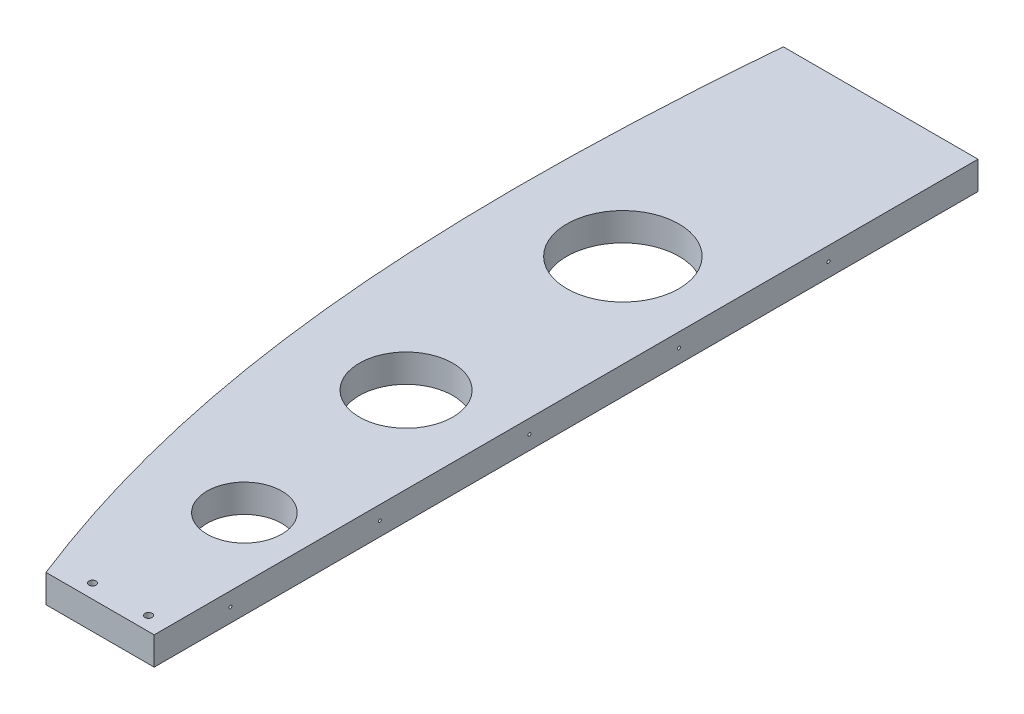
ISO-10303-21;
HEADER;
FILE_DESCRIPTION(('STEP AP214'),'2;1');
FILE_NAME('part.step','',(''),(''),'','','');
FILE_SCHEMA(('AUTOMOTIVE_DESIGN { 1 0 10303 214 1 1 1 1 }'));
ENDSEC;
DATA;
#1=APPLICATION_CONTEXT('core data for automotive mechanical design processes');
#2=APPLICATION_PROTOCOL_DEFINITION('international standard','automotive_design',2000,#1);
#3=PRODUCT_CONTEXT('',#1,'mechanical');
#4=PRODUCT('Part','Part','',(#3));
#5=PRODUCT_RELATED_PRODUCT_CATEGORY('part','',(#4));
#6=PRODUCT_DEFINITION_FORMATION('','',#4);
#7=PRODUCT_DEFINITION_CONTEXT('part definition',#1,'design');
#8=PRODUCT_DEFINITION('design','',#6,#7);
#9=PRODUCT_DEFINITION_SHAPE('','',#8);
#10=(LENGTH_UNIT() NAMED_UNIT(*) SI_UNIT(.MILLI.,.METRE.));
#11=(NAMED_UNIT(*) PLANE_ANGLE_UNIT() SI_UNIT($,.RADIAN.));
#12=(NAMED_UNIT(*) SI_UNIT($,.STERADIAN.) SOLID_ANGLE_UNIT());
#13=UNCERTAINTY_MEASURE_WITH_UNIT(LENGTH_MEASURE(1.E-05),#10,'distance_accuracy_value','');
#14=(GEOMETRIC_REPRESENTATION_CONTEXT(3) GLOBAL_UNCERTAINTY_ASSIGNED_CONTEXT((#13)) GLOBAL_UNIT_ASSIGNED_CONTEXT((#10,
#11,#12)) REPRESENTATION_CONTEXT('',''));
#15=CARTESIAN_POINT('',(0.,0.,0.));
#16=DIRECTION('',(0.,0.,1.));
#17=DIRECTION('',(1.,0.,0.));
#18=AXIS2_PLACEMENT_3D('',#15,#16,#17);
#19=CARTESIAN_POINT('',(-395.938510352722,5549.9,2963.39820667187));
#20=DIRECTION('',(0.,1.,0.));
#21=DIRECTION('',(1.,0.,0.));
#22=AXIS2_PLACEMENT_3D('',#19,#20,#21);
#23=PLANE('',#22);
#24=CARTESIAN_POINT('',(-376.528681754821,5549.9,3233.76141324196));
#25=DIRECTION('',(0.,-1.,0.));
#26=DIRECTION('',(1.,0.,0.));
#27=AXIS2_PLACEMENT_3D('',#24,#25,#26);
#28=CIRCLE('',#27,2.45744999999997);
#29=CARTESIAN_POINT('',(-374.071231754821,5549.9,3233.76141324196));
#30=VERTEX_POINT('',#29);
#31=EDGE_CURVE('E439',#30,#30,#28,.T.);
#32=ORIENTED_EDGE('',*,*,#31,.F.);
#33=EDGE_LOOP('',(#32));
#34=FACE_BOUND('',#33,.T.);
#35=CARTESIAN_POINT('',(-338.428578956981,5549.9,3233.76141324205));
#36=DIRECTION('',(0.,-1.,0.));
#37=DIRECTION('',(1.,0.,0.));
#38=AXIS2_PLACEMENT_3D('',#35,#36,#37);
#39=CIRCLE('',#38,2.45744999999997);
#40=CARTESIAN_POINT('',(-335.971128956981,5549.9,3233.76141324205));
#41=VERTEX_POINT('',#40);
#42=EDGE_CURVE('E128',#41,#41,#39,.T.);
#43=ORIENTED_EDGE('',*,*,#42,.F.);
#44=EDGE_LOOP('',(#43));
#45=FACE_BOUND('',#44,.T.);
#46=CARTESIAN_POINT('',(-388.619999999985,5549.9,2861.31));
#47=DIRECTION('',(0.,-1.,0.));
#48=DIRECTION('',(1.,0.,0.));
#49=AXIS2_PLACEMENT_3D('',#46,#47,#48);
#50=CIRCLE('',#49,38.0999999999997);
#51=CARTESIAN_POINT('',(-350.519999999985,5549.9,2861.31));
#52=VERTEX_POINT('',#51);
#53=EDGE_CURVE('E168',#52,#52,#50,.T.);
#54=ORIENTED_EDGE('',*,*,#53,.F.);
#55=EDGE_LOOP('',(#54));
#56=FACE_BOUND('',#55,.T.);
#57=CARTESIAN_POINT('',(-383.539999999984,5549.9,3013.71));
#58=DIRECTION('',(0.,-1.,0.));
#59=DIRECTION('',(1.,0.,0.));
#60=AXIS2_PLACEMENT_3D('',#57,#58,#59);
#61=CIRCLE('',#60,31.75);
#62=CARTESIAN_POINT('',(-351.789999999984,5549.9,3013.71));
#63=VERTEX_POINT('',#62);
#64=EDGE_CURVE('E464',#63,#63,#61,.T.);
#65=ORIENTED_EDGE('',*,*,#64,.F.);
#66=EDGE_LOOP('',(#65));
#67=FACE_BOUND('',#66,.T.);
#68=CARTESIAN_POINT('',(-366.394999999984,5549.9,3140.71));
#69=DIRECTION('',(0.,-1.,0.));
#70=DIRECTION('',(1.,0.,0.));
#71=AXIS2_PLACEMENT_3D('',#68,#69,#70);
#72=CIRCLE('',#71,25.4);
#73=CARTESIAN_POINT('',(-340.994999999984,5549.9,3140.71));
#74=VERTEX_POINT('',#73);
#75=EDGE_CURVE('E181',#74,#74,#72,.T.);
#76=ORIENTED_EDGE('',*,*,#75,.F.);
#77=EDGE_LOOP('',(#76));
#78=FACE_BOUND('',#77,.T.);
#79=DIRECTION('',(0.,0.,1.));
#80=VECTOR('',#79,1.);
#81=CARTESIAN_POINT('',(-325.12,5549.9,2683.51));
#82=LINE('',#81,#80);
#83=CARTESIAN_POINT('',(-325.12,5549.9,2683.51));
#84=VERTEX_POINT('',#83);
#85=CARTESIAN_POINT('',(-325.12,5549.9,3243.28641334377));
#86=VERTEX_POINT('',#85);
#87=EDGE_CURVE('E173',#84,#86,#82,.T.);
#88=ORIENTED_EDGE('',*,*,#87,.T.);
#89=DIRECTION('',(-1.,0.,0.));
#90=VECTOR('',#89,1.);
#91=CARTESIAN_POINT('',(-325.12,5549.9,3243.28641334377));
#92=LINE('',#91,#90);
#93=CARTESIAN_POINT('',(-398.616067459073,5549.9,3243.28641334376));
#94=VERTEX_POINT('',#93);
#95=EDGE_CURVE('E199',#86,#94,#92,.T.);
#96=ORIENTED_EDGE('',*,*,#95,.T.);
#97=CARTESIAN_POINT('',(-398.616067459073,5549.9,3243.28641334376));
#98=CARTESIAN_POINT('',(-399.391254354249,5549.9,3241.31643941946));
#99=CARTESIAN_POINT('',(-400.159771946541,5549.9,3239.34384037501));
#100=CARTESIAN_POINT('',(-401.683308273386,5549.9,3235.3935260428));
#101=CARTESIAN_POINT('',(-402.438327540983,5549.9,3233.41581096063));
#102=CARTESIAN_POINT('',(-403.934753074233,5549.9,3229.45528302953));
#103=CARTESIAN_POINT('',(-404.676159617436,5549.9,3227.47247028548));
#104=CARTESIAN_POINT('',(-406.145485254065,5549.9,3223.50115186715));
#105=CARTESIAN_POINT('',(-406.87340007338,5549.9,3221.51264461165));
#106=CARTESIAN_POINT('',(-408.315409595479,5549.9,3217.53057616089));
#107=CARTESIAN_POINT('',(-409.029504010926,5549.9,3215.53701486152));
#108=CARTESIAN_POINT('',(-410.443784650397,5549.9,3211.54487773681));
#109=CARTESIAN_POINT('',(-411.143970279183,5549.9,3209.54630170097));
#110=CARTESIAN_POINT('',(-413.924796825673,5549.9,3201.51873163861));
#111=CARTESIAN_POINT('',(-415.948841486582,5549.9,3195.46999950884));
#112=CARTESIAN_POINT('',(-419.86786750047,5549.9,3183.33007269644));
#113=CARTESIAN_POINT('',(-421.762832082675,5549.9,3177.23887260906));
#114=CARTESIAN_POINT('',(-425.422427121144,5549.9,3165.01700514525));
#115=CARTESIAN_POINT('',(-427.187049310552,5549.9,3158.88633529227));
#116=CARTESIAN_POINT('',(-430.585512685607,5549.9,3146.58889174867));
#117=CARTESIAN_POINT('',(-432.219354382257,5549.9,3140.42211819922));
#118=CARTESIAN_POINT('',(-435.357372122892,5549.9,3128.05321738843));
#119=CARTESIAN_POINT('',(-436.86149932901,5549.9,3121.85107774053));
#120=CARTESIAN_POINT('',(-439.740649568867,5549.9,3109.41710957125));
#121=CARTESIAN_POINT('',(-441.115676283978,5549.9,3103.18528190178));
#122=CARTESIAN_POINT('',(-443.738657817965,5549.9,3090.69501786939));
#123=CARTESIAN_POINT('',(-444.986613882392,5549.9,3084.43658176791));
#124=CARTESIAN_POINT('',(-447.358070937325,5549.9,3071.89634733286));
#125=CARTESIAN_POINT('',(-448.481574270177,5549.90000000001,3065.61454944128));
#126=CARTESIAN_POINT('',(-450.959202772401,5549.90000000001,3050.94728471009));
#127=CARTESIAN_POINT('',(-452.266536668403,5549.9,3042.553883485));
#128=CARTESIAN_POINT('',(-454.674970323464,5549.9,3025.73760485585));
#129=CARTESIAN_POINT('',(-455.776068123822,5549.9,3017.3147271726));
#130=CARTESIAN_POINT('',(-457.781734473296,5549.9,3000.44559812988));
#131=CARTESIAN_POINT('',(-458.686301386225,5549.9,2991.99934657639));
#132=CARTESIAN_POINT('',(-460.309158182782,5549.9,2975.08983570134));
#133=CARTESIAN_POINT('',(-461.027464844443,5549.9,2966.62657798091));
#134=CARTESIAN_POINT('',(-462.288581630136,5549.9,2949.68715658898));
#135=CARTESIAN_POINT('',(-462.831394684957,5549.9,2941.21099313538));
#136=CARTESIAN_POINT('',(-463.522040592226,5549.9,2928.49034900381));
#137=CARTESIAN_POINT('',(-463.73165863672,5549.9,2924.2491150432));
#138=CARTESIAN_POINT('',(-464.111045111048,5549.9,2915.76485644083));
#139=CARTESIAN_POINT('',(-464.280813611034,5549.9,2911.52183180224));
#140=CARTESIAN_POINT('',(-464.543893782736,5549.9,2904.10341936462));
#141=CARTESIAN_POINT('',(-464.645692509932,5549.9,2900.92832853059));
#142=CARTESIAN_POINT('',(-464.782642510266,5549.9,2896.16524637707));
#143=CARTESIAN_POINT('',(-464.825667804945,5549.9,2894.57747907896));
#144=CARTESIAN_POINT('',(-464.906437301377,5549.9,2891.40180867514));
#145=CARTESIAN_POINT('',(-464.944181497302,5549.9,2889.81390556928));
#146=CARTESIAN_POINT('',(-465.049630713981,5549.9,2885.05012986421));
#147=CARTESIAN_POINT('',(-465.109555502826,5549.9,2881.87408139542));
#148=CARTESIAN_POINT('',(-465.209293669796,5549.9,2875.52166888438));
#149=CARTESIAN_POINT('',(-465.249106998609,5549.9,2872.34530484138));
#150=CARTESIAN_POINT('',(-465.339279193302,5549.9,2862.81707241095));
#151=CARTESIAN_POINT('',(-465.360395446422,5549.9,2856.46490585253));
#152=CARTESIAN_POINT('',(-465.328911747632,5549.9,2843.76069302108));
#153=CARTESIAN_POINT('',(-465.276310667106,5549.9,2837.40864675138));
#154=CARTESIAN_POINT('',(-465.10371715051,5549.9,2824.90056477656));
#155=CARTESIAN_POINT('',(-464.985843659626,5549.9,2818.74449953624));
#156=CARTESIAN_POINT('',(-464.687072530091,5549.9,2806.43379985709));
#157=CARTESIAN_POINT('',(-464.506173786313,5549.9,2800.27916544525));
#158=CARTESIAN_POINT('',(-464.083727288669,5549.9,2787.97184820662));
#159=CARTESIAN_POINT('',(-463.842178185526,5549.9,2781.81916542631));
#160=CARTESIAN_POINT('',(-463.300390781291,5549.9,2769.51628781189));
#161=CARTESIAN_POINT('',(-463.000151506003,5549.9,2763.36609302079));
#162=CARTESIAN_POINT('',(-462.342479114975,5549.9,2751.06749509507));
#163=CARTESIAN_POINT('',(-461.985034229911,5549.9,2744.91909259054));
#164=CARTESIAN_POINT('',(-461.214161076097,5549.9,2732.62589828629));
#165=CARTESIAN_POINT('',(-460.800733667989,5549.9,2726.48110643251));
#166=CARTESIAN_POINT('',(-459.918658659862,5549.9,2714.19573926707));
#167=CARTESIAN_POINT('',(-459.450013380929,5549.9,2708.05516378908));
#168=CARTESIAN_POINT('',(-458.705858250388,5549.9,2698.84786595679));
#169=CARTESIAN_POINT('',(-458.450951410518,5549.9,2695.77946560644));
#170=CARTESIAN_POINT('',(-457.927384186114,5549.9,2689.64383870023));
#171=CARTESIAN_POINT('',(-457.658723802266,5549.9,2686.57661214431));
#172=CARTESIAN_POINT('',(-457.383176281735,5549.9,2683.51));
#173=B_SPLINE_CURVE_WITH_KNOTS('',3,(#97,#98,#99,#100,#101,#102,#103,#104,#105,#106,#107,#108,
#109,#110,#111,#112,#113,#114,#115,#116,#117,#118,#119,#120,#121,#122,#123,#124,#125,#126,#127,
#128,#129,#130,#131,#132,#133,#134,#135,#136,#137,#138,#139,#140,#141,#142,#143,#144,#145,#146,
#147,#148,#149,#150,#151,#152,#153,#154,#155,#156,#157,#158,#159,#160,#161,#162,#163,#164,#165,
#166,#167,#168,#169,#170,#171,#172),.UNSPECIFIED.,.F.,.F.,(4,2,2,2,2,2,2,2,2,2,2,2,2,2,2,2,2,2,
2,2,2,2,2,2,2,2,2,2,2,2,2,2,2,2,2,2,2,4),(0.,6.35100513389862,12.701758911567,19.0523830586236,
25.4049858028808,31.7577204810348,38.1107264467635,57.2443005221606,76.3803558108267,
95.5176237474081,114.654816904936,133.799184095804,152.943005208752,172.086638655151,
191.229911734631,216.71091196258,242.192154180929,267.673608531116,293.152766753604,
318.631499445493,331.370582215211,344.109642558367,353.639740098639,358.404782446425,
363.169830052399,372.699596689319,382.229386692556,401.285492509783,420.341890080029,
438.813133582083,457.284700987462,475.756679362759,494.228964380041,512.705054731664,
531.18086107531,549.655891064216,558.892775373888,568.129659224018),.UNSPECIFIED.);
#174=CARTESIAN_POINT('',(-457.383176281734,5549.9,2683.51));
#175=VERTEX_POINT('',#174);
#176=EDGE_CURVE('E186',#94,#175,#173,.T.);
#177=ORIENTED_EDGE('',*,*,#176,.T.);
#178=DIRECTION('',(1.,0.,0.));
#179=VECTOR('',#178,1.);
#180=CARTESIAN_POINT('',(-457.383176281734,5549.9,2683.51));
#181=LINE('',#180,#179);
#182=EDGE_CURVE('E174',#175,#84,#181,.T.);
#183=ORIENTED_EDGE('',*,*,#182,.T.);
#184=EDGE_LOOP('',(#88,#96,#177,#183));
#185=FACE_BOUND('',#184,.T.);
#186=ADVANCED_FACE('F49',(#34,#45,#56,#67,#78,#185),#23,.F.);
#187=CARTESIAN_POINT('',(-325.12,5549.9,3243.28641334377));
#188=DIRECTION('',(0.,0.,1.));
#189=DIRECTION('',(-1.,0.,0.));
#190=AXIS2_PLACEMENT_3D('',#187,#188,#189);
#191=PLANE('',#190);
#192=DIRECTION('',(1.,0.,0.));
#193=VECTOR('',#192,1.);
#194=CARTESIAN_POINT('',(-395.938510352721,5568.95,3243.28641334377));
#195=LINE('',#194,#193);
#196=CARTESIAN_POINT('',(-325.12,5568.95,3243.28641334377));
#197=VERTEX_POINT('',#196);
#198=CARTESIAN_POINT('',(-398.616067459076,5568.95,3243.28641334377));
#199=VERTEX_POINT('',#198);
#200=EDGE_CURVE('E166',#197,#199,#195,.F.);
#201=ORIENTED_EDGE('',*,*,#200,.T.);
#202=DIRECTION('',(1.36890498936282E-13,-1.,0.));
#203=VECTOR('',#202,1.);
#204=CARTESIAN_POINT('',(-398.616067459076,5559.425,3243.28641334377));
#205=LINE('',#204,#203);
#206=EDGE_CURVE('E94',#199,#94,#205,.T.);
#207=ORIENTED_EDGE('',*,*,#206,.T.);
#208=ORIENTED_EDGE('',*,*,#95,.F.);
#209=DIRECTION('',(0.,-1.,0.));
#210=VECTOR('',#209,1.);
#211=CARTESIAN_POINT('',(-325.12,5549.9,3243.28641334377));
#212=LINE('',#211,#210);
#213=EDGE_CURVE('E182',#86,#197,#212,.F.);
#214=ORIENTED_EDGE('',*,*,#213,.T.);
#215=EDGE_LOOP('',(#201,#207,#208,#214));
#216=FACE_BOUND('',#215,.T.);
#217=ADVANCED_FACE('F244',(#216),#191,.T.);
#218=CARTESIAN_POINT('',(-398.616067459074,5549.9,3243.28641334377));
#219=CARTESIAN_POINT('',(-398.616067459076,5568.95,3243.28641334377));
#220=CARTESIAN_POINT('',(-438.958601174539,5549.9,3140.76412449457));
#221=CARTESIAN_POINT('',(-438.958601174541,5568.95,3140.76412449457));
#222=CARTESIAN_POINT('',(-461.136779739803,5549.9,3031.41462020298));
#223=CARTESIAN_POINT('',(-461.136779739803,5568.95,3031.41462020298));
#224=CARTESIAN_POINT('',(-466.748734721918,5549.9,2823.19952309334));
#225=CARTESIAN_POINT('',(-466.748734721918,5568.95,2823.19952309334));
#226=CARTESIAN_POINT('',(-463.282210542618,5549.9,2749.16015817367));
#227=CARTESIAN_POINT('',(-463.282210542618,5568.95,2749.16015817366));
#228=CARTESIAN_POINT('',(-457.383176281734,5549.9,2683.51));
#229=CARTESIAN_POINT('',(-457.383176281733,5568.95,2683.51));
#230=B_SPLINE_SURFACE_WITH_KNOTS('',3,1,((#218,#219),(#220,#221),(#222,#223),(#224,#225),(#226,
#227),(#228,#229)),.UNSPECIFIED.,.F.,.F.,.F.,(4,2,4),(2,2),(-55.3716029639308,-25.0699273348478,
-9.0667694452729),(0.,1.90499999999997),.UNSPECIFIED.);
#231=CARTESIAN_POINT('',(-398.616067459077,5568.95,3243.28641334377));
#232=CARTESIAN_POINT('',(-399.391254354251,5568.95,3241.31643941946));
#233=CARTESIAN_POINT('',(-400.159771946543,5568.95,3239.34384037501));
#234=CARTESIAN_POINT('',(-401.683308273388,5568.95,3235.39352604281));
#235=CARTESIAN_POINT('',(-402.438327540986,5568.95,3233.41581096063));
#236=CARTESIAN_POINT('',(-403.934753074236,5568.95,3229.45528302953));
#237=CARTESIAN_POINT('',(-404.676159617439,5568.95,3227.47247028548));
#238=CARTESIAN_POINT('',(-406.145485254068,5568.95,3223.50115186715));
#239=CARTESIAN_POINT('',(-406.873400073383,5568.95,3221.51264461165));
#240=CARTESIAN_POINT('',(-408.315409595481,5568.95,3217.53057616089));
#241=CARTESIAN_POINT('',(-409.029504010929,5568.95,3215.53701486152));
#242=CARTESIAN_POINT('',(-410.4437846504,5568.95,3211.54487773681));
#243=CARTESIAN_POINT('',(-411.143970279185,5568.95,3209.54630170097));
#244=CARTESIAN_POINT('',(-413.924796825673,5568.95,3201.51873163861));
#245=CARTESIAN_POINT('',(-415.948841486583,5568.95,3195.46999950884));
#246=CARTESIAN_POINT('',(-419.867867500473,5568.95,3183.33007269644));
#247=CARTESIAN_POINT('',(-421.762832082678,5568.95,3177.23887260906));
#248=CARTESIAN_POINT('',(-425.422427121147,5568.95,3165.01700514525));
#249=CARTESIAN_POINT('',(-427.187049310554,5568.95,3158.88633529227));
#250=CARTESIAN_POINT('',(-430.58551268561,5568.95,3146.58889174867));
#251=CARTESIAN_POINT('',(-432.219354382259,5568.95,3140.42211819922));
#252=CARTESIAN_POINT('',(-435.357372122894,5568.95,3128.05321738843));
#253=CARTESIAN_POINT('',(-436.861499329012,5568.95,3121.85107774053));
#254=CARTESIAN_POINT('',(-439.740649568869,5568.95,3109.41710957125));
#255=CARTESIAN_POINT('',(-441.115676283979,5568.95,3103.18528190178));
#256=CARTESIAN_POINT('',(-443.738657817966,5568.95,3090.69501786939));
#257=CARTESIAN_POINT('',(-444.986613882394,5568.95,3084.43658176791));
#258=CARTESIAN_POINT('',(-447.358070937326,5568.95,3071.89634733286));
#259=CARTESIAN_POINT('',(-448.481574270177,5568.95,3065.61454944128));
#260=CARTESIAN_POINT('',(-450.9592027724,5568.95,3050.94728471008));
#261=CARTESIAN_POINT('',(-452.266536668403,5568.95,3042.553883485));
#262=CARTESIAN_POINT('',(-454.674970323466,5568.95,3025.73760485584));
#263=CARTESIAN_POINT('',(-455.776068123824,5568.95,3017.3147271726));
#264=CARTESIAN_POINT('',(-457.781734473296,5568.95,3000.44559812987));
#265=CARTESIAN_POINT('',(-458.686301386226,5568.95,2991.99934657639));
#266=CARTESIAN_POINT('',(-460.309158182783,5568.95,2975.08983570133));
#267=CARTESIAN_POINT('',(-461.027464844443,5568.95,2966.62657798091));
#268=CARTESIAN_POINT('',(-462.288581630136,5568.95,2949.68715658898));
#269=CARTESIAN_POINT('',(-462.831394684957,5568.95,2941.21099313538));
#270=CARTESIAN_POINT('',(-463.522040592226,5568.95,2928.49034900381));
#271=CARTESIAN_POINT('',(-463.73165863672,5568.95,2924.24911504319));
#272=CARTESIAN_POINT('',(-464.111045111048,5568.95,2915.76485644083));
#273=CARTESIAN_POINT('',(-464.280813611034,5568.95,2911.52183180224));
#274=CARTESIAN_POINT('',(-464.543893782736,5568.95,2904.10341936462));
#275=CARTESIAN_POINT('',(-464.645692509932,5568.95,2900.92832853059));
#276=CARTESIAN_POINT('',(-464.782642510266,5568.95,2896.16524637706));
#277=CARTESIAN_POINT('',(-464.825667804945,5568.95,2894.57747907896));
#278=CARTESIAN_POINT('',(-464.906437301377,5568.95,2891.40180867514));
#279=CARTESIAN_POINT('',(-464.944181497302,5568.95,2889.81390556928));
#280=CARTESIAN_POINT('',(-465.049630713982,5568.95,2885.05012986421));
#281=CARTESIAN_POINT('',(-465.109555502827,5568.95,2881.87408139541));
#282=CARTESIAN_POINT('',(-465.209293669797,5568.95,2875.52166888437));
#283=CARTESIAN_POINT('',(-465.24910699861,5568.95,2872.34530484138));
#284=CARTESIAN_POINT('',(-465.339279193302,5568.95,2862.81707241094));
#285=CARTESIAN_POINT('',(-465.360395446422,5568.95,2856.46490585253));
#286=CARTESIAN_POINT('',(-465.328911747632,5568.95,2843.76069302108));
#287=CARTESIAN_POINT('',(-465.276310667107,5568.95000000001,2837.40864675138));
#288=CARTESIAN_POINT('',(-465.103717150511,5568.95000000001,2824.90056477656));
#289=CARTESIAN_POINT('',(-464.985843659626,5568.95,2818.74449953624));
#290=CARTESIAN_POINT('',(-464.687072530091,5568.95,2806.43379985709));
#291=CARTESIAN_POINT('',(-464.506173786313,5568.95,2800.27916544525));
#292=CARTESIAN_POINT('',(-464.083727288669,5568.95,2787.97184820662));
#293=CARTESIAN_POINT('',(-463.842178185526,5568.95,2781.81916542631));
#294=CARTESIAN_POINT('',(-463.300390781291,5568.95,2769.51628781189));
#295=CARTESIAN_POINT('',(-463.000151506003,5568.95,2763.36609302078));
#296=CARTESIAN_POINT('',(-462.342479114975,5568.95,2751.06749509507));
#297=CARTESIAN_POINT('',(-461.98503422991,5568.95,2744.91909259054));
#298=CARTESIAN_POINT('',(-461.214161076096,5568.95,2732.62589828628));
#299=CARTESIAN_POINT('',(-460.800733667989,5568.95,2726.48110643251));
#300=CARTESIAN_POINT('',(-459.918658659861,5568.95,2714.19573926707));
#301=CARTESIAN_POINT('',(-459.450013380928,5568.95,2708.05516378908));
#302=CARTESIAN_POINT('',(-458.705858250387,5568.95,2698.84786595678));
#303=CARTESIAN_POINT('',(-458.450951410516,5568.95,2695.77946560644));
#304=CARTESIAN_POINT('',(-457.927384186113,5568.95,2689.64383870023));
#305=CARTESIAN_POINT('',(-457.658723802265,5568.95,2686.57661214431));
#306=CARTESIAN_POINT('',(-457.383176281734,5568.95,2683.51));
#307=B_SPLINE_CURVE_WITH_KNOTS('',3,(#231,#232,#233,#234,#235,#236,#237,#238,#239,#240,#241,
#242,#243,#244,#245,#246,#247,#248,#249,#250,#251,#252,#253,#254,#255,#256,#257,#258,#259,#260,
#261,#262,#263,#264,#265,#266,#267,#268,#269,#270,#271,#272,#273,#274,#275,#276,#277,#278,#279,
#280,#281,#282,#283,#284,#285,#286,#287,#288,#289,#290,#291,#292,#293,#294,#295,#296,#297,#298,
#299,#300,#301,#302,#303,#304,#305,#306),.UNSPECIFIED.,.F.,.F.,(4,2,2,2,2,2,2,2,2,2,2,2,2,2,2,2,
2,2,2,2,2,2,2,2,2,2,2,2,2,2,2,2,2,2,2,2,2,4),(0.,6.35100513389849,12.7017589115675,
19.052383058624,25.4049858028807,31.7577204810353,38.1107264467641,57.2443005221619,
76.380355810828,95.5176237474102,114.654816904939,133.799184095807,152.943005208756,
172.086638655155,191.229911734636,216.710911962585,242.192154180933,267.67360853112,
293.152766753608,318.631499445496,331.370582215214,344.109642558371,353.639740098642,
358.404782446428,363.169830052402,372.699596689321,382.229386692559,401.285492509787,
420.341890080033,438.813133582087,457.284700987464,475.756679362761,494.228964380044,
512.705054731666,531.180861075312,549.655891064218,558.892775373889,568.129659224019),.UNSPECIFIED.);
#308=CARTESIAN_POINT('',(-457.383176281734,5568.95,2683.51));
#309=VERTEX_POINT('',#308);
#310=EDGE_CURVE('E163',#199,#309,#307,.T.);
#311=DIRECTION('',(0.,1.,0.));
#312=VECTOR('',#311,1.);
#313=CARTESIAN_POINT('',(-457.383176281734,5549.9,2683.51));
#314=LINE('',#313,#312);
#315=EDGE_CURVE('E171',#309,#175,#314,.F.);
#316=ORIENTED_EDGE('',*,*,#310,.T.);
#317=ORIENTED_EDGE('',*,*,#315,.T.);
#318=ORIENTED_EDGE('',*,*,#176,.F.);
#319=ORIENTED_EDGE('',*,*,#206,.F.);
#320=EDGE_LOOP('',(#316,#317,#318,#319));
#321=FACE_BOUND('',#320,.T.);
#322=ADVANCED_FACE('F51',(#321),#230,.F.);
#323=CARTESIAN_POINT('',(-457.383176281734,5549.9,2683.51));
#324=DIRECTION('',(0.,0.,-1.));
#325=DIRECTION('',(1.,0.,0.));
#326=AXIS2_PLACEMENT_3D('',#323,#324,#325);
#327=PLANE('',#326);
#328=CARTESIAN_POINT('',(-424.072610901227,5559.425,2683.51));
#329=DIRECTION('',(0.,0.,1.));
#330=DIRECTION('',(1.,0.,0.));
#331=AXIS2_PLACEMENT_3D('',#328,#329,#330);
#332=CIRCLE('',#331,0.991870000000006);
#333=CARTESIAN_POINT('',(-423.080740901227,5559.425,2683.51));
#334=VERTEX_POINT('',#333);
#335=EDGE_CURVE('E155',#334,#334,#332,.T.);
#336=ORIENTED_EDGE('',*,*,#335,.T.);
#337=EDGE_LOOP('',(#336));
#338=FACE_BOUND('',#337,.T.);
#339=CARTESIAN_POINT('',(-358.104203633742,5559.425,2683.51));
#340=DIRECTION('',(0.,0.,1.));
#341=DIRECTION('',(1.,0.,0.));
#342=AXIS2_PLACEMENT_3D('',#339,#340,#341);
#343=CIRCLE('',#342,0.991870000000006);
#344=CARTESIAN_POINT('',(-357.112333633742,5559.425,2683.51));
#345=VERTEX_POINT('',#344);
#346=EDGE_CURVE('E159',#345,#345,#343,.T.);
#347=ORIENTED_EDGE('',*,*,#346,.T.);
#348=EDGE_LOOP('',(#347));
#349=FACE_BOUND('',#348,.T.);
#350=DIRECTION('',(1.,0.,0.));
#351=VECTOR('',#350,1.);
#352=CARTESIAN_POINT('',(-395.938510352721,5568.95,2683.51));
#353=LINE('',#352,#351);
#354=CARTESIAN_POINT('',(-325.119999999999,5568.95,2683.51));
#355=VERTEX_POINT('',#354);
#356=EDGE_CURVE('E160',#309,#355,#353,.T.);
#357=ORIENTED_EDGE('',*,*,#356,.T.);
#358=DIRECTION('',(0.,-1.,0.));
#359=VECTOR('',#358,1.);
#360=CARTESIAN_POINT('',(-325.12,5549.9,2683.51));
#361=LINE('',#360,#359);
#362=EDGE_CURVE('E179',#355,#84,#361,.T.);
#363=ORIENTED_EDGE('',*,*,#362,.T.);
#364=ORIENTED_EDGE('',*,*,#182,.F.);
#365=ORIENTED_EDGE('',*,*,#315,.F.);
#366=EDGE_LOOP('',(#357,#363,#364,#365));
#367=FACE_BOUND('',#366,.T.);
#368=ADVANCED_FACE('F239',(#338,#349,#367),#327,.T.);
#369=CARTESIAN_POINT('',(-325.12,5549.9,2683.51));
#370=DIRECTION('',(1.,0.,0.));
#371=DIRECTION('',(0.,-1.,0.));
#372=AXIS2_PLACEMENT_3D('',#369,#370,#371);
#373=PLANE('',#372);
#374=CARTESIAN_POINT('',(-325.120000000001,5559.425,2785.11));
#375=DIRECTION('',(-1.,0.,0.));
#376=DIRECTION('',(0.,-1.,0.));
#377=AXIS2_PLACEMENT_3D('',#374,#375,#376);
#378=CIRCLE('',#377,0.991870000000006);
#379=CARTESIAN_POINT('',(-325.12,5558.43313,2785.11));
#380=VERTEX_POINT('',#379);
#381=EDGE_CURVE('E56',#380,#380,#378,.T.);
#382=ORIENTED_EDGE('',*,*,#381,.T.);
#383=EDGE_LOOP('',(#382));
#384=FACE_BOUND('',#383,.T.);
#385=CARTESIAN_POINT('',(-325.119999999999,5559.425,2886.71));
#386=DIRECTION('',(-1.,0.,0.));
#387=DIRECTION('',(0.,-1.,0.));
#388=AXIS2_PLACEMENT_3D('',#385,#386,#387);
#389=CIRCLE('',#388,0.991870000000006);
#390=CARTESIAN_POINT('',(-325.119999999999,5558.43313,2886.71));
#391=VERTEX_POINT('',#390);
#392=EDGE_CURVE('E139',#391,#391,#389,.T.);
#393=ORIENTED_EDGE('',*,*,#392,.T.);
#394=EDGE_LOOP('',(#393));
#395=FACE_BOUND('',#394,.T.);
#396=CARTESIAN_POINT('',(-325.120000000001,5559.425,2988.31));
#397=DIRECTION('',(-1.,0.,0.));
#398=DIRECTION('',(0.,-1.,0.));
#399=AXIS2_PLACEMENT_3D('',#396,#397,#398);
#400=CIRCLE('',#399,0.991870000000006);
#401=CARTESIAN_POINT('',(-325.120000000001,5558.43313,2988.31));
#402=VERTEX_POINT('',#401);
#403=EDGE_CURVE('E143',#402,#402,#400,.T.);
#404=ORIENTED_EDGE('',*,*,#403,.T.);
#405=EDGE_LOOP('',(#404));
#406=FACE_BOUND('',#405,.T.);
#407=CARTESIAN_POINT('',(-325.120000000001,5559.425,3089.91));
#408=DIRECTION('',(-1.,0.,0.));
#409=DIRECTION('',(0.,-1.,0.));
#410=AXIS2_PLACEMENT_3D('',#407,#408,#409);
#411=CIRCLE('',#410,0.991870000000006);
#412=CARTESIAN_POINT('',(-325.120000000001,5558.43313,3089.91));
#413=VERTEX_POINT('',#412);
#414=EDGE_CURVE('E147',#413,#413,#411,.T.);
#415=ORIENTED_EDGE('',*,*,#414,.T.);
#416=EDGE_LOOP('',(#415));
#417=FACE_BOUND('',#416,.T.);
#418=CARTESIAN_POINT('',(-325.12,5559.42499999999,3191.51));
#419=DIRECTION('',(-1.,0.,0.));
#420=DIRECTION('',(0.,-1.,0.));
#421=AXIS2_PLACEMENT_3D('',#418,#419,#420);
#422=CIRCLE('',#421,0.991870000000006);
#423=CARTESIAN_POINT('',(-325.12,5558.43312999999,3191.51));
#424=VERTEX_POINT('',#423);
#425=EDGE_CURVE('E151',#424,#424,#422,.T.);
#426=ORIENTED_EDGE('',*,*,#425,.T.);
#427=EDGE_LOOP('',(#426));
#428=FACE_BOUND('',#427,.T.);
#429=DIRECTION('',(0.,0.,1.));
#430=VECTOR('',#429,1.);
#431=CARTESIAN_POINT('',(-325.120000000001,5568.95,2963.39820667187));
#432=LINE('',#431,#430);
#433=EDGE_CURVE('E71',#355,#197,#432,.T.);
#434=ORIENTED_EDGE('',*,*,#433,.T.);
#435=ORIENTED_EDGE('',*,*,#213,.F.);
#436=ORIENTED_EDGE('',*,*,#87,.F.);
#437=ORIENTED_EDGE('',*,*,#362,.F.);
#438=EDGE_LOOP('',(#434,#435,#436,#437));
#439=FACE_BOUND('',#438,.T.);
#440=ADVANCED_FACE('F235',(#384,#395,#406,#417,#428,#439),#373,.T.);
#441=CARTESIAN_POINT('',(-366.395,5194.3,3140.71));
#442=DIRECTION('',(0.,1.,0.));
#443=DIRECTION('',(1.,0.,0.));
#444=AXIS2_PLACEMENT_3D('',#441,#442,#443);
#445=CYLINDRICAL_SURFACE('',#444,25.4);
#446=ORIENTED_EDGE('',*,*,#75,.T.);
#447=EDGE_LOOP('',(#446));
#448=FACE_BOUND('',#447,.T.);
#449=CARTESIAN_POINT('',(-366.394999999984,5568.95,3140.71));
#450=DIRECTION('',(0.,-1.,0.));
#451=DIRECTION('',(1.,0.,0.));
#452=AXIS2_PLACEMENT_3D('',#449,#450,#451);
#453=CIRCLE('',#452,25.4);
#454=CARTESIAN_POINT('',(-340.994999999984,5568.95,3140.71));
#455=VERTEX_POINT('',#454);
#456=EDGE_CURVE('E176',#455,#455,#453,.F.);
#457=ORIENTED_EDGE('',*,*,#456,.T.);
#458=EDGE_LOOP('',(#457));
#459=FACE_BOUND('',#458,.T.);
#460=ADVANCED_FACE('F231',(#448,#459),#445,.F.);
#461=CARTESIAN_POINT('',(-383.539999999999,5194.3,3013.71));
#462=DIRECTION('',(0.,1.,0.));
#463=DIRECTION('',(1.,0.,0.));
#464=AXIS2_PLACEMENT_3D('',#461,#462,#463);
#465=CYLINDRICAL_SURFACE('',#464,31.75);
#466=ORIENTED_EDGE('',*,*,#64,.T.);
#467=EDGE_LOOP('',(#466));
#468=FACE_BOUND('',#467,.T.);
#469=CARTESIAN_POINT('',(-383.539999999983,5568.95,3013.71));
#470=DIRECTION('',(0.,-1.,0.));
#471=DIRECTION('',(1.,0.,0.));
#472=AXIS2_PLACEMENT_3D('',#469,#470,#471);
#473=CIRCLE('',#472,31.75);
#474=CARTESIAN_POINT('',(-351.789999999983,5568.95,3013.71));
#475=VERTEX_POINT('',#474);
#476=EDGE_CURVE('E62',#475,#475,#473,.F.);
#477=ORIENTED_EDGE('',*,*,#476,.T.);
#478=EDGE_LOOP('',(#477));
#479=FACE_BOUND('',#478,.T.);
#480=ADVANCED_FACE('F227',(#468,#479),#465,.F.);
#481=CARTESIAN_POINT('',(-388.62,5194.3,2861.31));
#482=DIRECTION('',(0.,1.,0.));
#483=DIRECTION('',(1.,0.,0.));
#484=AXIS2_PLACEMENT_3D('',#481,#482,#483);
#485=CYLINDRICAL_SURFACE('',#484,38.0999999999997);
#486=ORIENTED_EDGE('',*,*,#53,.T.);
#487=EDGE_LOOP('',(#486));
#488=FACE_BOUND('',#487,.T.);
#489=CARTESIAN_POINT('',(-388.619999999984,5568.95,2861.31));
#490=DIRECTION('',(0.,-1.,0.));
#491=DIRECTION('',(1.,0.,0.));
#492=AXIS2_PLACEMENT_3D('',#489,#490,#491);
#493=CIRCLE('',#492,38.0999999999997);
#494=CARTESIAN_POINT('',(-350.519999999984,5568.95,2861.31));
#495=VERTEX_POINT('',#494);
#496=EDGE_CURVE('E13',#495,#495,#493,.F.);
#497=ORIENTED_EDGE('',*,*,#496,.T.);
#498=EDGE_LOOP('',(#497));
#499=FACE_BOUND('',#498,.T.);
#500=ADVANCED_FACE('F222',(#488,#499),#485,.F.);
#501=CARTESIAN_POINT('',(-395.938510352721,5568.95,2963.39820667187));
#502=DIRECTION('',(0.,1.,0.));
#503=DIRECTION('',(1.,0.,0.));
#504=AXIS2_PLACEMENT_3D('',#501,#502,#503);
#505=PLANE('',#504);
#506=CARTESIAN_POINT('',(-376.52868175482,5568.95,3233.76141324196));
#507=DIRECTION('',(0.,-1.,0.));
#508=DIRECTION('',(0.,0.,1.));
#509=AXIS2_PLACEMENT_3D('',#506,#507,#508);
#510=CIRCLE('',#509,2.45744999999997);
#511=CARTESIAN_POINT('',(-376.52868175482,5568.95,3236.21886324196));
#512=VERTEX_POINT('',#511);
#513=EDGE_CURVE('E436',#512,#512,#510,.T.);
#514=ORIENTED_EDGE('',*,*,#513,.T.);
#515=EDGE_LOOP('',(#514));
#516=FACE_BOUND('',#515,.T.);
#517=CARTESIAN_POINT('',(-338.428578956982,5568.95,3233.76141324205));
#518=DIRECTION('',(0.,-1.,0.));
#519=DIRECTION('',(0.,0.,1.));
#520=AXIS2_PLACEMENT_3D('',#517,#518,#519);
#521=CIRCLE('',#520,2.45744999999997);
#522=CARTESIAN_POINT('',(-338.428578956982,5568.95,3236.21886324205));
#523=VERTEX_POINT('',#522);
#524=EDGE_CURVE('E133',#523,#523,#521,.T.);
#525=ORIENTED_EDGE('',*,*,#524,.T.);
#526=EDGE_LOOP('',(#525));
#527=FACE_BOUND('',#526,.T.);
#528=ORIENTED_EDGE('',*,*,#496,.F.);
#529=EDGE_LOOP('',(#528));
#530=FACE_BOUND('',#529,.T.);
#531=ORIENTED_EDGE('',*,*,#476,.F.);
#532=EDGE_LOOP('',(#531));
#533=FACE_BOUND('',#532,.T.);
#534=ORIENTED_EDGE('',*,*,#456,.F.);
#535=EDGE_LOOP('',(#534));
#536=FACE_BOUND('',#535,.T.);
#537=ORIENTED_EDGE('',*,*,#356,.F.);
#538=ORIENTED_EDGE('',*,*,#310,.F.);
#539=ORIENTED_EDGE('',*,*,#200,.F.);
#540=ORIENTED_EDGE('',*,*,#433,.F.);
#541=EDGE_LOOP('',(#537,#538,#539,#540));
#542=FACE_BOUND('',#541,.T.);
#543=ADVANCED_FACE('F216',(#516,#527,#530,#533,#536,#542),#505,.T.);
#544=CARTESIAN_POINT('',(-358.104203633743,5559.42499999999,2702.56));
#545=DIRECTION('',(0.,0.,-1.));
#546=DIRECTION('',(1.,0.,0.));
#547=AXIS2_PLACEMENT_3D('',#544,#545,#546);
#548=CONICAL_SURFACE('',#547,0.991870000000006,1.02974425867677);
#549=CARTESIAN_POINT('',(-358.104203633743,5559.42500000001,2703.1559756222));
#550=VERTEX_POINT('',#549);
#551=VERTEX_LOOP('',#550);
#552=FACE_BOUND('',#551,.T.);
#553=CARTESIAN_POINT('',(-358.104203633743,5559.42499999999,2702.56));
#554=DIRECTION('',(0.,0.,1.));
#555=DIRECTION('',(1.,0.,0.));
#556=AXIS2_PLACEMENT_3D('',#553,#554,#555);
#557=CIRCLE('',#556,0.991870000000006);
#558=CARTESIAN_POINT('',(-357.112333633743,5559.42499999999,2702.56));
#559=VERTEX_POINT('',#558);
#560=EDGE_CURVE('E156',#559,#559,#557,.T.);
#561=ORIENTED_EDGE('',*,*,#560,.F.);
#562=EDGE_LOOP('',(#561));
#563=FACE_BOUND('',#562,.T.);
#564=ADVANCED_FACE('F221',(#552,#563),#548,.F.);
#565=CARTESIAN_POINT('',(-358.104203633741,5559.425,2664.46));
#566=DIRECTION('',(0.,0.,-1.));
#567=DIRECTION('',(1.,0.,0.));
#568=AXIS2_PLACEMENT_3D('',#565,#566,#567);
#569=CYLINDRICAL_SURFACE('',#568,0.991870000000006);
#570=ORIENTED_EDGE('',*,*,#346,.F.);
#571=EDGE_LOOP('',(#570));
#572=FACE_BOUND('',#571,.T.);
#573=ORIENTED_EDGE('',*,*,#560,.T.);
#574=EDGE_LOOP('',(#573));
#575=FACE_BOUND('',#574,.T.);
#576=ADVANCED_FACE('F313',(#572,#575),#569,.F.);
#577=CARTESIAN_POINT('',(-424.072610901228,5559.42499999999,2702.56));
#578=DIRECTION('',(0.,0.,-1.));
#579=DIRECTION('',(1.,0.,0.));
#580=AXIS2_PLACEMENT_3D('',#577,#578,#579);
#581=CONICAL_SURFACE('',#580,0.991870000000006,1.02974425867677);
#582=CARTESIAN_POINT('',(-424.072610901226,5559.425,2703.1559756222));
#583=VERTEX_POINT('',#582);
#584=VERTEX_LOOP('',#583);
#585=FACE_BOUND('',#584,.T.);
#586=CARTESIAN_POINT('',(-424.072610901228,5559.42499999999,2702.56));
#587=DIRECTION('',(0.,0.,1.));
#588=DIRECTION('',(1.,0.,0.));
#589=AXIS2_PLACEMENT_3D('',#586,#587,#588);
#590=CIRCLE('',#589,0.991870000000006);
#591=CARTESIAN_POINT('',(-423.080740901228,5559.42499999999,2702.56));
#592=VERTEX_POINT('',#591);
#593=EDGE_CURVE('E152',#592,#592,#590,.T.);
#594=ORIENTED_EDGE('',*,*,#593,.F.);
#595=EDGE_LOOP('',(#594));
#596=FACE_BOUND('',#595,.T.);
#597=ADVANCED_FACE('F310',(#585,#596),#581,.F.);
#598=CARTESIAN_POINT('',(-424.072610901226,5559.425,2664.46));
#599=DIRECTION('',(0.,0.,-1.));
#600=DIRECTION('',(1.,0.,0.));
#601=AXIS2_PLACEMENT_3D('',#598,#599,#600);
#602=CYLINDRICAL_SURFACE('',#601,0.991870000000006);
#603=ORIENTED_EDGE('',*,*,#335,.F.);
#604=EDGE_LOOP('',(#603));
#605=FACE_BOUND('',#604,.T.);
#606=ORIENTED_EDGE('',*,*,#593,.T.);
#607=EDGE_LOOP('',(#606));
#608=FACE_BOUND('',#607,.T.);
#609=ADVANCED_FACE('F306',(#605,#608),#602,.F.);
#610=CARTESIAN_POINT('',(-344.169999999999,5559.42499999999,3191.51));
#611=DIRECTION('',(1.,0.,0.));
#612=DIRECTION('',(0.,0.,1.));
#613=AXIS2_PLACEMENT_3D('',#610,#611,#612);
#614=CONICAL_SURFACE('',#613,0.991870000000006,1.02974425867665);
#615=CARTESIAN_POINT('',(-344.765975622195,5559.42499999999,3191.51));
#616=VERTEX_POINT('',#615);
#617=VERTEX_LOOP('',#616);
#618=FACE_BOUND('',#617,.T.);
#619=CARTESIAN_POINT('',(-344.169999999999,5559.42499999999,3191.51));
#620=DIRECTION('',(-1.,0.,0.));
#621=DIRECTION('',(0.,0.,1.));
#622=AXIS2_PLACEMENT_3D('',#619,#620,#621);
#623=CIRCLE('',#622,0.991870000000006);
#624=CARTESIAN_POINT('',(-344.169999999999,5559.42499999999,3192.50187));
#625=VERTEX_POINT('',#624);
#626=EDGE_CURVE('E148',#625,#625,#623,.T.);
#627=ORIENTED_EDGE('',*,*,#626,.F.);
#628=EDGE_LOOP('',(#627));
#629=FACE_BOUND('',#628,.T.);
#630=ADVANCED_FACE('F302',(#618,#629),#614,.F.);
#631=CARTESIAN_POINT('',(-312.419999999999,5559.42499999999,3191.51));
#632=DIRECTION('',(1.,0.,0.));
#633=DIRECTION('',(0.,0.,1.));
#634=AXIS2_PLACEMENT_3D('',#631,#632,#633);
#635=CYLINDRICAL_SURFACE('',#634,0.991870000000006);
#636=ORIENTED_EDGE('',*,*,#425,.F.);
#637=EDGE_LOOP('',(#636));
#638=FACE_BOUND('',#637,.T.);
#639=ORIENTED_EDGE('',*,*,#626,.T.);
#640=EDGE_LOOP('',(#639));
#641=FACE_BOUND('',#640,.T.);
#642=ADVANCED_FACE('F298',(#638,#641),#635,.F.);
#643=CARTESIAN_POINT('',(-344.17,5559.425,3089.91));
#644=DIRECTION('',(1.,0.,0.));
#645=DIRECTION('',(0.,0.,1.));
#646=AXIS2_PLACEMENT_3D('',#643,#644,#645);
#647=CONICAL_SURFACE('',#646,0.991870000000006,1.02974425867665);
#648=CARTESIAN_POINT('',(-344.765975622195,5559.425,3089.91));
#649=VERTEX_POINT('',#648);
#650=VERTEX_LOOP('',#649);
#651=FACE_BOUND('',#650,.T.);
#652=CARTESIAN_POINT('',(-344.17,5559.425,3089.91));
#653=DIRECTION('',(-1.,0.,0.));
#654=DIRECTION('',(0.,0.,1.));
#655=AXIS2_PLACEMENT_3D('',#652,#653,#654);
#656=CIRCLE('',#655,0.991870000000006);
#657=CARTESIAN_POINT('',(-344.17,5559.425,3090.90187));
#658=VERTEX_POINT('',#657);
#659=EDGE_CURVE('E144',#658,#658,#656,.T.);
#660=ORIENTED_EDGE('',*,*,#659,.F.);
#661=EDGE_LOOP('',(#660));
#662=FACE_BOUND('',#661,.T.);
#663=ADVANCED_FACE('F294',(#651,#662),#647,.F.);
#664=CARTESIAN_POINT('',(-312.42,5559.425,3089.91));
#665=DIRECTION('',(1.,0.,0.));
#666=DIRECTION('',(0.,0.,1.));
#667=AXIS2_PLACEMENT_3D('',#664,#665,#666);
#668=CYLINDRICAL_SURFACE('',#667,0.991870000000006);
#669=ORIENTED_EDGE('',*,*,#414,.F.);
#670=EDGE_LOOP('',(#669));
#671=FACE_BOUND('',#670,.T.);
#672=ORIENTED_EDGE('',*,*,#659,.T.);
#673=EDGE_LOOP('',(#672));
#674=FACE_BOUND('',#673,.T.);
#675=ADVANCED_FACE('F290',(#671,#674),#668,.F.);
#676=CARTESIAN_POINT('',(-344.17,5559.425,2988.31));
#677=DIRECTION('',(1.,0.,0.));
#678=DIRECTION('',(0.,0.,1.));
#679=AXIS2_PLACEMENT_3D('',#676,#677,#678);
#680=CONICAL_SURFACE('',#679,0.991870000000006,1.02974425867665);
#681=CARTESIAN_POINT('',(-344.765975622195,5559.425,2988.31));
#682=VERTEX_POINT('',#681);
#683=VERTEX_LOOP('',#682);
#684=FACE_BOUND('',#683,.T.);
#685=CARTESIAN_POINT('',(-344.17,5559.425,2988.31));
#686=DIRECTION('',(-1.,0.,0.));
#687=DIRECTION('',(0.,0.,1.));
#688=AXIS2_PLACEMENT_3D('',#685,#686,#687);
#689=CIRCLE('',#688,0.991870000000006);
#690=CARTESIAN_POINT('',(-344.17,5559.425,2989.30187));
#691=VERTEX_POINT('',#690);
#692=EDGE_CURVE('E140',#691,#691,#689,.T.);
#693=ORIENTED_EDGE('',*,*,#692,.F.);
#694=EDGE_LOOP('',(#693));
#695=FACE_BOUND('',#694,.T.);
#696=ADVANCED_FACE('F284',(#684,#695),#680,.F.);
#697=CARTESIAN_POINT('',(-312.42,5559.425,2988.31));
#698=DIRECTION('',(1.,0.,0.));
#699=DIRECTION('',(0.,0.,1.));
#700=AXIS2_PLACEMENT_3D('',#697,#698,#699);
#701=CYLINDRICAL_SURFACE('',#700,0.991870000000006);
#702=ORIENTED_EDGE('',*,*,#403,.F.);
#703=EDGE_LOOP('',(#702));
#704=FACE_BOUND('',#703,.T.);
#705=ORIENTED_EDGE('',*,*,#692,.T.);
#706=EDGE_LOOP('',(#705));
#707=FACE_BOUND('',#706,.T.);
#708=ADVANCED_FACE('F278',(#704,#707),#701,.F.);
#709=CARTESIAN_POINT('',(-344.17,5559.425,2886.71));
#710=DIRECTION('',(1.,0.,0.));
#711=DIRECTION('',(0.,0.,1.));
#712=AXIS2_PLACEMENT_3D('',#709,#710,#711);
#713=CONICAL_SURFACE('',#712,0.991870000000006,1.02974425867665);
#714=CARTESIAN_POINT('',(-344.765975622194,5559.425,2886.71));
#715=VERTEX_POINT('',#714);
#716=VERTEX_LOOP('',#715);
#717=FACE_BOUND('',#716,.T.);
#718=CARTESIAN_POINT('',(-344.17,5559.425,2886.71));
#719=DIRECTION('',(-1.,0.,0.));
#720=DIRECTION('',(0.,0.,1.));
#721=AXIS2_PLACEMENT_3D('',#718,#719,#720);
#722=CIRCLE('',#721,0.991870000000006);
#723=CARTESIAN_POINT('',(-344.17,5559.425,2887.70187));
#724=VERTEX_POINT('',#723);
#725=EDGE_CURVE('E131',#724,#724,#722,.T.);
#726=ORIENTED_EDGE('',*,*,#725,.F.);
#727=EDGE_LOOP('',(#726));
#728=FACE_BOUND('',#727,.T.);
#729=ADVANCED_FACE('F273',(#717,#728),#713,.F.);
#730=CARTESIAN_POINT('',(-312.419999999999,5559.425,2886.71));
#731=DIRECTION('',(1.,0.,0.));
#732=DIRECTION('',(0.,0.,1.));
#733=AXIS2_PLACEMENT_3D('',#730,#731,#732);
#734=CYLINDRICAL_SURFACE('',#733,0.991870000000006);
#735=ORIENTED_EDGE('',*,*,#392,.F.);
#736=EDGE_LOOP('',(#735));
#737=FACE_BOUND('',#736,.T.);
#738=ORIENTED_EDGE('',*,*,#725,.T.);
#739=EDGE_LOOP('',(#738));
#740=FACE_BOUND('',#739,.T.);
#741=ADVANCED_FACE('F122',(#737,#740),#734,.F.);
#742=CARTESIAN_POINT('',(-344.17,5559.425,2785.11));
#743=DIRECTION('',(1.,0.,0.));
#744=DIRECTION('',(0.,0.,1.));
#745=AXIS2_PLACEMENT_3D('',#742,#743,#744);
#746=CONICAL_SURFACE('',#745,0.991870000000006,1.02974425867665);
#747=CARTESIAN_POINT('',(-344.765975622195,5559.425,2785.11));
#748=VERTEX_POINT('',#747);
#749=VERTEX_LOOP('',#748);
#750=FACE_BOUND('',#749,.T.);
#751=CARTESIAN_POINT('',(-344.17,5559.425,2785.11));
#752=DIRECTION('',(-1.,0.,0.));
#753=DIRECTION('',(0.,0.,1.));
#754=AXIS2_PLACEMENT_3D('',#751,#752,#753);
#755=CIRCLE('',#754,0.991870000000006);
#756=CARTESIAN_POINT('',(-344.17,5559.425,2786.10187));
#757=VERTEX_POINT('',#756);
#758=EDGE_CURVE('E126',#757,#757,#755,.T.);
#759=ORIENTED_EDGE('',*,*,#758,.F.);
#760=EDGE_LOOP('',(#759));
#761=FACE_BOUND('',#760,.T.);
#762=ADVANCED_FACE('F118',(#750,#761),#746,.F.);
#763=CARTESIAN_POINT('',(-312.42,5559.425,2785.11));
#764=DIRECTION('',(1.,0.,0.));
#765=DIRECTION('',(0.,0.,1.));
#766=AXIS2_PLACEMENT_3D('',#763,#764,#765);
#767=CYLINDRICAL_SURFACE('',#766,0.991870000000006);
#768=ORIENTED_EDGE('',*,*,#381,.F.);
#769=EDGE_LOOP('',(#768));
#770=FACE_BOUND('',#769,.T.);
#771=ORIENTED_EDGE('',*,*,#758,.T.);
#772=EDGE_LOOP('',(#771));
#773=FACE_BOUND('',#772,.T.);
#774=ADVANCED_FACE('F121',(#770,#773),#767,.F.);
#775=CARTESIAN_POINT('',(-338.428578956982,5568.95,3233.76141324205));
#776=DIRECTION('',(0.,1.,0.));
#777=DIRECTION('',(0.,0.,1.));
#778=AXIS2_PLACEMENT_3D('',#775,#776,#777);
#779=CYLINDRICAL_SURFACE('',#778,2.45744999999997);
#780=ORIENTED_EDGE('',*,*,#524,.F.);
#781=EDGE_LOOP('',(#780));
#782=FACE_BOUND('',#781,.T.);
#783=ORIENTED_EDGE('',*,*,#42,.T.);
#784=EDGE_LOOP('',(#783));
#785=FACE_BOUND('',#784,.T.);
#786=ADVANCED_FACE('F415',(#782,#785),#779,.F.);
#787=CARTESIAN_POINT('',(-376.52868175482,5568.95,3233.76141324196));
#788=DIRECTION('',(0.,1.,0.));
#789=DIRECTION('',(0.,0.,1.));
#790=AXIS2_PLACEMENT_3D('',#787,#788,#789);
#791=CYLINDRICAL_SURFACE('',#790,2.45744999999997);
#792=ORIENTED_EDGE('',*,*,#513,.F.);
#793=EDGE_LOOP('',(#792));
#794=FACE_BOUND('',#793,.T.);
#795=ORIENTED_EDGE('',*,*,#31,.T.);
#796=EDGE_LOOP('',(#795));
#797=FACE_BOUND('',#796,.T.);
#798=ADVANCED_FACE('F423',(#794,#797),#791,.F.);
#799=CLOSED_SHELL('',(#186,#217,#322,#368,#440,#460,#480,#500,#543,#564,#576,#597,#609,#630,
#642,#663,#675,#696,#708,#729,#741,#762,#774,#786,#798));
#800=MANIFOLD_SOLID_BREP('B2',#799);
#801=ADVANCED_BREP_SHAPE_REPRESENTATION('',(#18,#800),#14);
#802=SHAPE_DEFINITION_REPRESENTATION(#9,#801);
ENDSEC;
END-ISO-10303-21;
